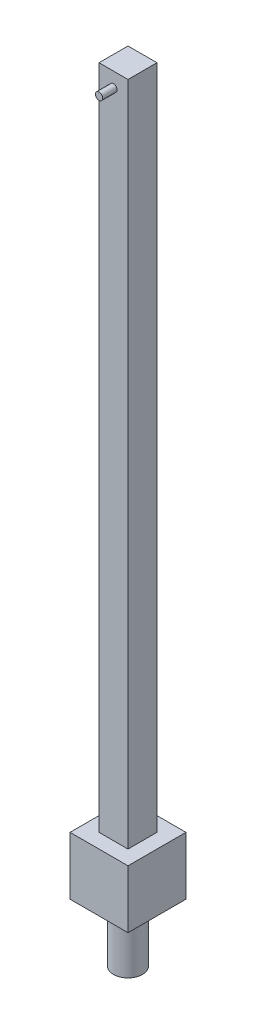
ISO-10303-21;
HEADER;
FILE_DESCRIPTION(('STEP AP214'),'2;1');
FILE_NAME('part.step','',(''),(''),'','','');
FILE_SCHEMA(('AUTOMOTIVE_DESIGN { 1 0 10303 214 1 1 1 1 }'));
ENDSEC;
DATA;
#1=APPLICATION_CONTEXT('core data for automotive mechanical design processes');
#2=APPLICATION_PROTOCOL_DEFINITION('international standard','automotive_design',2000,#1);
#3=PRODUCT_CONTEXT('',#1,'mechanical');
#4=PRODUCT('Part','Part','',(#3));
#5=PRODUCT_RELATED_PRODUCT_CATEGORY('part','',(#4));
#6=PRODUCT_DEFINITION_FORMATION('','',#4);
#7=PRODUCT_DEFINITION_CONTEXT('part definition',#1,'design');
#8=PRODUCT_DEFINITION('design','',#6,#7);
#9=PRODUCT_DEFINITION_SHAPE('','',#8);
#10=(LENGTH_UNIT() NAMED_UNIT(*) SI_UNIT(.MILLI.,.METRE.));
#11=(NAMED_UNIT(*) PLANE_ANGLE_UNIT() SI_UNIT($,.RADIAN.));
#12=(NAMED_UNIT(*) SI_UNIT($,.STERADIAN.) SOLID_ANGLE_UNIT());
#13=UNCERTAINTY_MEASURE_WITH_UNIT(LENGTH_MEASURE(1.E-05),#10,'distance_accuracy_value','');
#14=(GEOMETRIC_REPRESENTATION_CONTEXT(3) GLOBAL_UNCERTAINTY_ASSIGNED_CONTEXT((#13)) GLOBAL_UNIT_ASSIGNED_CONTEXT((#10,
#11,#12)) REPRESENTATION_CONTEXT('',''));
#15=CARTESIAN_POINT('',(0.,0.,0.));
#16=DIRECTION('',(0.,0.,1.));
#17=DIRECTION('',(1.,0.,0.));
#18=AXIS2_PLACEMENT_3D('',#15,#16,#17);
#19=CARTESIAN_POINT('',(-10.,500.,-10.));
#20=DIRECTION('',(0.,0.,-1.));
#21=DIRECTION('',(-1.,0.,0.));
#22=AXIS2_PLACEMENT_3D('',#19,#20,#21);
#23=PLANE('',#22);
#24=DIRECTION('',(0.,-1.,0.));
#25=VECTOR('',#24,1.);
#26=CARTESIAN_POINT('',(10.,500.,-10.));
#27=LINE('',#26,#25);
#28=CARTESIAN_POINT('',(10.,500.,-10.));
#29=VERTEX_POINT('',#28);
#30=CARTESIAN_POINT('',(10.,40.,-10.));
#31=VERTEX_POINT('',#30);
#32=EDGE_CURVE('E189',#29,#31,#27,.T.);
#33=ORIENTED_EDGE('',*,*,#32,.T.);
#34=DIRECTION('',(-1.,0.,0.));
#35=VECTOR('',#34,1.);
#36=CARTESIAN_POINT('',(-10.,40.,-10.));
#37=LINE('',#36,#35);
#38=CARTESIAN_POINT('',(-10.,40.,-10.));
#39=VERTEX_POINT('',#38);
#40=EDGE_CURVE('E60',#31,#39,#37,.T.);
#41=ORIENTED_EDGE('',*,*,#40,.T.);
#42=DIRECTION('',(0.,-1.,0.));
#43=VECTOR('',#42,1.);
#44=CARTESIAN_POINT('',(-10.,500.,-10.));
#45=LINE('',#44,#43);
#46=CARTESIAN_POINT('',(-10.,500.,-10.));
#47=VERTEX_POINT('',#46);
#48=EDGE_CURVE('E67',#47,#39,#45,.T.);
#49=ORIENTED_EDGE('',*,*,#48,.F.);
#50=DIRECTION('',(1.,0.,0.));
#51=VECTOR('',#50,1.);
#52=CARTESIAN_POINT('',(-10.,500.,-10.));
#53=LINE('',#52,#51);
#54=EDGE_CURVE('E176',#47,#29,#53,.T.);
#55=ORIENTED_EDGE('',*,*,#54,.T.);
#56=EDGE_LOOP('',(#33,#41,#49,#55));
#57=FACE_BOUND('',#56,.T.);
#58=ADVANCED_FACE('F45',(#57),#23,.T.);
#59=CARTESIAN_POINT('',(-10.,500.,-10.));
#60=DIRECTION('',(1.,0.,0.));
#61=DIRECTION('',(0.,0.,-1.));
#62=AXIS2_PLACEMENT_3D('',#59,#60,#61);
#63=PLANE('',#62);
#64=DIRECTION('',(0.,0.,-1.));
#65=VECTOR('',#64,1.);
#66=CARTESIAN_POINT('',(-10.,40.,-10.));
#67=LINE('',#66,#65);
#68=CARTESIAN_POINT('',(-10.,40.,10.));
#69=VERTEX_POINT('',#68);
#70=EDGE_CURVE('E171',#69,#39,#67,.T.);
#71=ORIENTED_EDGE('',*,*,#70,.F.);
#72=DIRECTION('',(0.,-1.,0.));
#73=VECTOR('',#72,1.);
#74=CARTESIAN_POINT('',(-10.,500.,10.));
#75=LINE('',#74,#73);
#76=CARTESIAN_POINT('',(-10.,500.,10.));
#77=VERTEX_POINT('',#76);
#78=EDGE_CURVE('E193',#77,#69,#75,.T.);
#79=ORIENTED_EDGE('',*,*,#78,.F.);
#80=DIRECTION('',(0.,0.,1.));
#81=VECTOR('',#80,1.);
#82=CARTESIAN_POINT('',(-10.,500.,-10.));
#83=LINE('',#82,#81);
#84=EDGE_CURVE('E186',#47,#77,#83,.T.);
#85=ORIENTED_EDGE('',*,*,#84,.F.);
#86=ORIENTED_EDGE('',*,*,#48,.T.);
#87=EDGE_LOOP('',(#71,#79,#85,#86));
#88=FACE_BOUND('',#87,.T.);
#89=ADVANCED_FACE('F230',(#88),#63,.F.);
#90=CARTESIAN_POINT('',(-10.,500.,10.));
#91=DIRECTION('',(0.,0.,-1.));
#92=DIRECTION('',(-1.,0.,0.));
#93=AXIS2_PLACEMENT_3D('',#90,#91,#92);
#94=PLANE('',#93);
#95=CARTESIAN_POINT('',(0.,490.,10.));
#96=DIRECTION('',(0.,0.,-1.));
#97=DIRECTION('',(-1.,0.,0.));
#98=AXIS2_PLACEMENT_3D('',#95,#96,#97);
#99=CIRCLE('',#98,2.5);
#100=CARTESIAN_POINT('',(-2.5,490.,10.));
#101=VERTEX_POINT('',#100);
#102=EDGE_CURVE('E11',#101,#101,#99,.F.);
#103=ORIENTED_EDGE('',*,*,#102,.F.);
#104=EDGE_LOOP('',(#103));
#105=FACE_BOUND('',#104,.T.);
#106=DIRECTION('',(-1.,0.,0.));
#107=VECTOR('',#106,1.);
#108=CARTESIAN_POINT('',(-10.,40.,10.));
#109=LINE('',#108,#107);
#110=CARTESIAN_POINT('',(10.,40.,10.));
#111=VERTEX_POINT('',#110);
#112=EDGE_CURVE('E163',#111,#69,#109,.T.);
#113=ORIENTED_EDGE('',*,*,#112,.F.);
#114=DIRECTION('',(0.,-1.,0.));
#115=VECTOR('',#114,1.);
#116=CARTESIAN_POINT('',(10.,500.,10.));
#117=LINE('',#116,#115);
#118=CARTESIAN_POINT('',(10.,500.,10.));
#119=VERTEX_POINT('',#118);
#120=EDGE_CURVE('E197',#119,#111,#117,.T.);
#121=ORIENTED_EDGE('',*,*,#120,.F.);
#122=DIRECTION('',(1.,0.,0.));
#123=VECTOR('',#122,1.);
#124=CARTESIAN_POINT('',(-10.,500.,10.));
#125=LINE('',#124,#123);
#126=EDGE_CURVE('E183',#77,#119,#125,.T.);
#127=ORIENTED_EDGE('',*,*,#126,.F.);
#128=ORIENTED_EDGE('',*,*,#78,.T.);
#129=EDGE_LOOP('',(#113,#121,#127,#128));
#130=FACE_BOUND('',#129,.T.);
#131=ADVANCED_FACE('F235',(#105,#130),#94,.F.);
#132=CARTESIAN_POINT('',(10.,500.,-10.));
#133=DIRECTION('',(1.,0.,0.));
#134=DIRECTION('',(0.,0.,-1.));
#135=AXIS2_PLACEMENT_3D('',#132,#133,#134);
#136=PLANE('',#135);
#137=ORIENTED_EDGE('',*,*,#120,.T.);
#138=DIRECTION('',(0.,0.,-1.));
#139=VECTOR('',#138,1.);
#140=CARTESIAN_POINT('',(10.,40.,-10.));
#141=LINE('',#140,#139);
#142=EDGE_CURVE('E192',#111,#31,#141,.T.);
#143=ORIENTED_EDGE('',*,*,#142,.T.);
#144=ORIENTED_EDGE('',*,*,#32,.F.);
#145=DIRECTION('',(0.,0.,1.));
#146=VECTOR('',#145,1.);
#147=CARTESIAN_POINT('',(10.,500.,-10.));
#148=LINE('',#147,#146);
#149=EDGE_CURVE('E179',#29,#119,#148,.T.);
#150=ORIENTED_EDGE('',*,*,#149,.T.);
#151=EDGE_LOOP('',(#137,#143,#144,#150));
#152=FACE_BOUND('',#151,.T.);
#153=ADVANCED_FACE('F240',(#152),#136,.T.);
#154=CARTESIAN_POINT('',(0.,500.,0.));
#155=DIRECTION('',(0.,-1.,0.));
#156=DIRECTION('',(0.,0.,-1.));
#157=AXIS2_PLACEMENT_3D('',#154,#155,#156);
#158=PLANE('',#157);
#159=ORIENTED_EDGE('',*,*,#54,.F.);
#160=ORIENTED_EDGE('',*,*,#84,.T.);
#161=ORIENTED_EDGE('',*,*,#126,.T.);
#162=ORIENTED_EDGE('',*,*,#149,.F.);
#163=EDGE_LOOP('',(#159,#160,#161,#162));
#164=FACE_BOUND('',#163,.T.);
#165=ADVANCED_FACE('F242',(#164),#158,.F.);
#166=CARTESIAN_POINT('',(20.,40.,20.));
#167=DIRECTION('',(1.,0.,0.));
#168=DIRECTION('',(0.,0.,-1.));
#169=AXIS2_PLACEMENT_3D('',#166,#167,#168);
#170=PLANE('',#169);
#171=DIRECTION('',(0.,0.,1.));
#172=VECTOR('',#171,1.);
#173=CARTESIAN_POINT('',(20.,0.,20.));
#174=LINE('',#173,#172);
#175=CARTESIAN_POINT('',(20.,0.,-20.));
#176=VERTEX_POINT('',#175);
#177=CARTESIAN_POINT('',(20.,0.,20.));
#178=VERTEX_POINT('',#177);
#179=EDGE_CURVE('E152',#176,#178,#174,.T.);
#180=ORIENTED_EDGE('',*,*,#179,.F.);
#181=DIRECTION('',(0.,-1.,0.));
#182=VECTOR('',#181,1.);
#183=CARTESIAN_POINT('',(20.,40.,-20.));
#184=LINE('',#183,#182);
#185=CARTESIAN_POINT('',(20.,40.,-20.));
#186=VERTEX_POINT('',#185);
#187=EDGE_CURVE('E137',#186,#176,#184,.T.);
#188=ORIENTED_EDGE('',*,*,#187,.F.);
#189=DIRECTION('',(0.,0.,1.));
#190=VECTOR('',#189,1.);
#191=CARTESIAN_POINT('',(20.,40.,20.));
#192=LINE('',#191,#190);
#193=CARTESIAN_POINT('',(20.,40.,20.));
#194=VERTEX_POINT('',#193);
#195=EDGE_CURVE('E130',#186,#194,#192,.T.);
#196=ORIENTED_EDGE('',*,*,#195,.T.);
#197=DIRECTION('',(0.,-1.,0.));
#198=VECTOR('',#197,1.);
#199=CARTESIAN_POINT('',(20.,40.,20.));
#200=LINE('',#199,#198);
#201=EDGE_CURVE('E111',#194,#178,#200,.T.);
#202=ORIENTED_EDGE('',*,*,#201,.T.);
#203=EDGE_LOOP('',(#180,#188,#196,#202));
#204=FACE_BOUND('',#203,.T.);
#205=ADVANCED_FACE('F136',(#204),#170,.T.);
#206=CARTESIAN_POINT('',(-20.,40.,-20.));
#207=DIRECTION('',(0.,0.,-1.));
#208=DIRECTION('',(-1.,0.,0.));
#209=AXIS2_PLACEMENT_3D('',#206,#207,#208);
#210=PLANE('',#209);
#211=DIRECTION('',(1.,0.,0.));
#212=VECTOR('',#211,1.);
#213=CARTESIAN_POINT('',(-20.,0.,-20.));
#214=LINE('',#213,#212);
#215=CARTESIAN_POINT('',(-20.,0.,-20.));
#216=VERTEX_POINT('',#215);
#217=EDGE_CURVE('E139',#216,#176,#214,.T.);
#218=ORIENTED_EDGE('',*,*,#217,.F.);
#219=DIRECTION('',(0.,-1.,0.));
#220=VECTOR('',#219,1.);
#221=CARTESIAN_POINT('',(-20.,40.,-20.));
#222=LINE('',#221,#220);
#223=CARTESIAN_POINT('',(-20.,40.,-20.));
#224=VERTEX_POINT('',#223);
#225=EDGE_CURVE('E164',#224,#216,#222,.T.);
#226=ORIENTED_EDGE('',*,*,#225,.F.);
#227=DIRECTION('',(1.,0.,0.));
#228=VECTOR('',#227,1.);
#229=CARTESIAN_POINT('',(-20.,40.,-20.));
#230=LINE('',#229,#228);
#231=EDGE_CURVE('E123',#224,#186,#230,.T.);
#232=ORIENTED_EDGE('',*,*,#231,.T.);
#233=ORIENTED_EDGE('',*,*,#187,.T.);
#234=EDGE_LOOP('',(#218,#226,#232,#233));
#235=FACE_BOUND('',#234,.T.);
#236=ADVANCED_FACE('F218',(#235),#210,.T.);
#237=CARTESIAN_POINT('',(-20.,40.,20.));
#238=DIRECTION('',(-1.,0.,0.));
#239=DIRECTION('',(0.,0.,1.));
#240=AXIS2_PLACEMENT_3D('',#237,#238,#239);
#241=PLANE('',#240);
#242=DIRECTION('',(0.,0.,-1.));
#243=VECTOR('',#242,1.);
#244=CARTESIAN_POINT('',(-20.,0.,20.));
#245=LINE('',#244,#243);
#246=CARTESIAN_POINT('',(-20.,0.,20.));
#247=VERTEX_POINT('',#246);
#248=EDGE_CURVE('E143',#247,#216,#245,.T.);
#249=ORIENTED_EDGE('',*,*,#248,.F.);
#250=DIRECTION('',(0.,-1.,0.));
#251=VECTOR('',#250,1.);
#252=CARTESIAN_POINT('',(-20.,40.,20.));
#253=LINE('',#252,#251);
#254=CARTESIAN_POINT('',(-20.,40.,20.));
#255=VERTEX_POINT('',#254);
#256=EDGE_CURVE('E122',#255,#247,#253,.T.);
#257=ORIENTED_EDGE('',*,*,#256,.F.);
#258=DIRECTION('',(0.,0.,-1.));
#259=VECTOR('',#258,1.);
#260=CARTESIAN_POINT('',(-20.,40.,20.));
#261=LINE('',#260,#259);
#262=EDGE_CURVE('E133',#255,#224,#261,.T.);
#263=ORIENTED_EDGE('',*,*,#262,.T.);
#264=ORIENTED_EDGE('',*,*,#225,.T.);
#265=EDGE_LOOP('',(#249,#257,#263,#264));
#266=FACE_BOUND('',#265,.T.);
#267=ADVANCED_FACE('F220',(#266),#241,.T.);
#268=CARTESIAN_POINT('',(-20.,40.,20.));
#269=DIRECTION('',(0.,0.,1.));
#270=DIRECTION('',(1.,0.,0.));
#271=AXIS2_PLACEMENT_3D('',#268,#269,#270);
#272=PLANE('',#271);
#273=DIRECTION('',(-1.,0.,0.));
#274=VECTOR('',#273,1.);
#275=CARTESIAN_POINT('',(-20.,0.,20.));
#276=LINE('',#275,#274);
#277=EDGE_CURVE('E116',#178,#247,#276,.T.);
#278=ORIENTED_EDGE('',*,*,#277,.F.);
#279=ORIENTED_EDGE('',*,*,#201,.F.);
#280=DIRECTION('',(-1.,0.,0.));
#281=VECTOR('',#280,1.);
#282=CARTESIAN_POINT('',(-20.,40.,20.));
#283=LINE('',#282,#281);
#284=EDGE_CURVE('E114',#194,#255,#283,.T.);
#285=ORIENTED_EDGE('',*,*,#284,.T.);
#286=ORIENTED_EDGE('',*,*,#256,.T.);
#287=EDGE_LOOP('',(#278,#279,#285,#286));
#288=FACE_BOUND('',#287,.T.);
#289=ADVANCED_FACE('F113',(#288),#272,.T.);
#290=CARTESIAN_POINT('',(0.,40.,0.));
#291=DIRECTION('',(0.,-1.,0.));
#292=DIRECTION('',(0.,0.,-1.));
#293=AXIS2_PLACEMENT_3D('',#290,#291,#292);
#294=PLANE('',#293);
#295=ORIENTED_EDGE('',*,*,#40,.F.);
#296=ORIENTED_EDGE('',*,*,#142,.F.);
#297=ORIENTED_EDGE('',*,*,#112,.T.);
#298=ORIENTED_EDGE('',*,*,#70,.T.);
#299=EDGE_LOOP('',(#295,#296,#297,#298));
#300=FACE_BOUND('',#299,.T.);
#301=ORIENTED_EDGE('',*,*,#195,.F.);
#302=ORIENTED_EDGE('',*,*,#231,.F.);
#303=ORIENTED_EDGE('',*,*,#262,.F.);
#304=ORIENTED_EDGE('',*,*,#284,.F.);
#305=EDGE_LOOP('',(#301,#302,#303,#304));
#306=FACE_BOUND('',#305,.T.);
#307=ADVANCED_FACE('F128',(#300,#306),#294,.F.);
#308=CARTESIAN_POINT('',(0.,0.,0.));
#309=DIRECTION('',(0.,-1.,0.));
#310=DIRECTION('',(0.,0.,-1.));
#311=AXIS2_PLACEMENT_3D('',#308,#309,#310);
#312=PLANE('',#311);
#313=CARTESIAN_POINT('',(0.,0.,0.));
#314=DIRECTION('',(0.,-1.,0.));
#315=DIRECTION('',(0.,0.,-1.));
#316=AXIS2_PLACEMENT_3D('',#313,#314,#315);
#317=CIRCLE('',#316,10.);
#318=CARTESIAN_POINT('',(0.,0.,-10.));
#319=VERTEX_POINT('',#318);
#320=EDGE_CURVE('E53',#319,#319,#317,.T.);
#321=ORIENTED_EDGE('',*,*,#320,.F.);
#322=EDGE_LOOP('',(#321));
#323=FACE_BOUND('',#322,.T.);
#324=ORIENTED_EDGE('',*,*,#179,.T.);
#325=ORIENTED_EDGE('',*,*,#277,.T.);
#326=ORIENTED_EDGE('',*,*,#248,.T.);
#327=ORIENTED_EDGE('',*,*,#217,.T.);
#328=EDGE_LOOP('',(#324,#325,#326,#327));
#329=FACE_BOUND('',#328,.T.);
#330=ADVANCED_FACE('F211',(#323,#329),#312,.T.);
#331=CARTESIAN_POINT('',(0.,-40.,0.));
#332=DIRECTION('',(0.,1.,0.));
#333=DIRECTION('',(0.,0.,1.));
#334=AXIS2_PLACEMENT_3D('',#331,#332,#333);
#335=CYLINDRICAL_SURFACE('',#334,10.);
#336=CARTESIAN_POINT('',(0.,-40.,0.));
#337=DIRECTION('',(0.,-1.,0.));
#338=DIRECTION('',(0.,0.,-1.));
#339=AXIS2_PLACEMENT_3D('',#336,#337,#338);
#340=CIRCLE('',#339,10.);
#341=CARTESIAN_POINT('',(0.,-40.,-10.));
#342=VERTEX_POINT('',#341);
#343=EDGE_CURVE('E155',#342,#342,#340,.T.);
#344=ORIENTED_EDGE('',*,*,#343,.F.);
#345=EDGE_LOOP('',(#344));
#346=FACE_BOUND('',#345,.T.);
#347=ORIENTED_EDGE('',*,*,#320,.T.);
#348=EDGE_LOOP('',(#347));
#349=FACE_BOUND('',#348,.T.);
#350=ADVANCED_FACE('F209',(#346,#349),#335,.T.);
#351=CARTESIAN_POINT('',(0.,-40.,0.));
#352=DIRECTION('',(0.,-1.,0.));
#353=DIRECTION('',(0.,0.,-1.));
#354=AXIS2_PLACEMENT_3D('',#351,#352,#353);
#355=PLANE('',#354);
#356=ORIENTED_EDGE('',*,*,#343,.T.);
#357=EDGE_LOOP('',(#356));
#358=FACE_BOUND('',#357,.T.);
#359=ADVANCED_FACE('F256',(#358),#355,.T.);
#360=CARTESIAN_POINT('',(0.,490.,20.));
#361=DIRECTION('',(0.,0.,-1.));
#362=DIRECTION('',(-1.,0.,0.));
#363=AXIS2_PLACEMENT_3D('',#360,#361,#362);
#364=CYLINDRICAL_SURFACE('',#363,2.5);
#365=CARTESIAN_POINT('',(0.,490.,20.));
#366=DIRECTION('',(0.,0.,1.));
#367=DIRECTION('',(1.,0.,0.));
#368=AXIS2_PLACEMENT_3D('',#365,#366,#367);
#369=CIRCLE('',#368,2.5);
#370=CARTESIAN_POINT('',(2.5,490.,20.));
#371=VERTEX_POINT('',#370);
#372=EDGE_CURVE('E272',#371,#371,#369,.T.);
#373=ORIENTED_EDGE('',*,*,#372,.F.);
#374=EDGE_LOOP('',(#373));
#375=FACE_BOUND('',#374,.T.);
#376=ORIENTED_EDGE('',*,*,#102,.T.);
#377=EDGE_LOOP('',(#376));
#378=FACE_BOUND('',#377,.T.);
#379=ADVANCED_FACE('F260',(#375,#378),#364,.T.);
#380=CARTESIAN_POINT('',(0.,490.,20.));
#381=DIRECTION('',(0.,0.,1.));
#382=DIRECTION('',(1.,0.,0.));
#383=AXIS2_PLACEMENT_3D('',#380,#381,#382);
#384=PLANE('',#383);
#385=ORIENTED_EDGE('',*,*,#372,.T.);
#386=EDGE_LOOP('',(#385));
#387=FACE_BOUND('',#386,.T.);
#388=ADVANCED_FACE('F264',(#387),#384,.T.);
#389=CLOSED_SHELL('',(#58,#89,#131,#153,#165,#205,#236,#267,#289,#307,#330,#350,#359,#379,#388));
#390=MANIFOLD_SOLID_BREP('B2',#389);
#391=ADVANCED_BREP_SHAPE_REPRESENTATION('',(#18,#390),#14);
#392=SHAPE_DEFINITION_REPRESENTATION(#9,#391);
ENDSEC;
END-ISO-10303-21;
